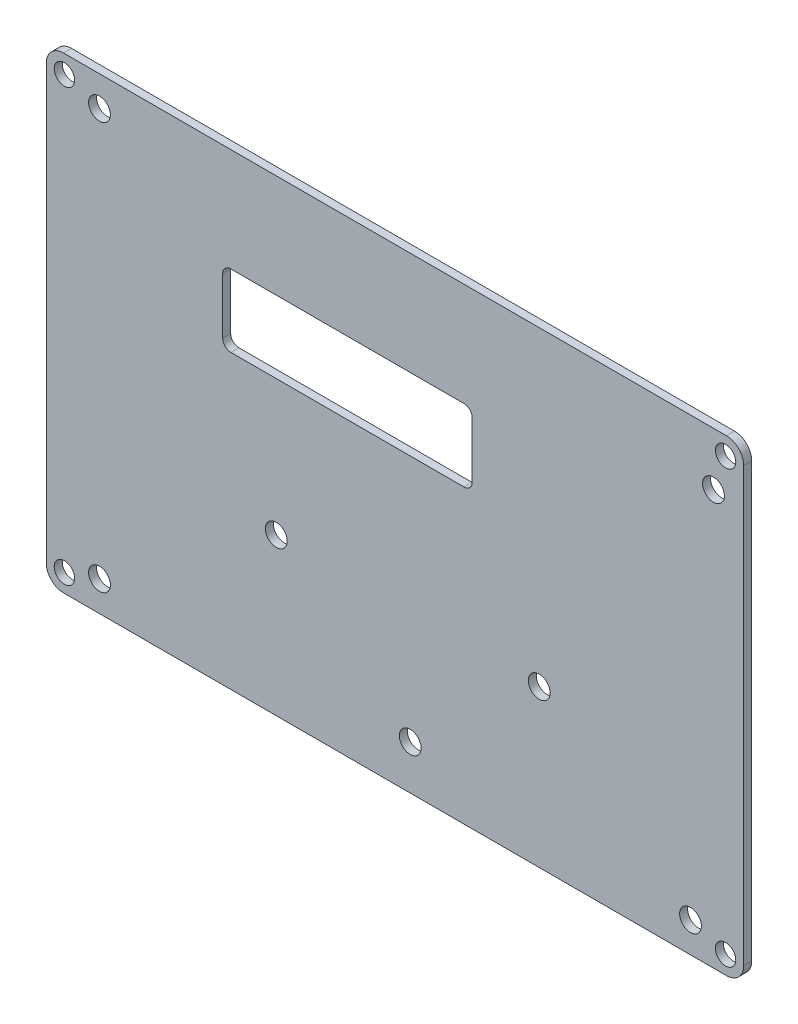
ISO-10303-21;
HEADER;
FILE_DESCRIPTION(('STEP AP214'),'2;1');
FILE_NAME('part.step','',(''),(''),'','','');
FILE_SCHEMA(('AUTOMOTIVE_DESIGN { 1 0 10303 214 1 1 1 1 }'));
ENDSEC;
DATA;
#1=APPLICATION_CONTEXT('core data for automotive mechanical design processes');
#2=APPLICATION_PROTOCOL_DEFINITION('international standard','automotive_design',2000,#1);
#3=PRODUCT_CONTEXT('',#1,'mechanical');
#4=PRODUCT('Part','Part','',(#3));
#5=PRODUCT_RELATED_PRODUCT_CATEGORY('part','',(#4));
#6=PRODUCT_DEFINITION_FORMATION('','',#4);
#7=PRODUCT_DEFINITION_CONTEXT('part definition',#1,'design');
#8=PRODUCT_DEFINITION('design','',#6,#7);
#9=PRODUCT_DEFINITION_SHAPE('','',#8);
#10=(LENGTH_UNIT() NAMED_UNIT(*) SI_UNIT(.MILLI.,.METRE.));
#11=(NAMED_UNIT(*) PLANE_ANGLE_UNIT() SI_UNIT($,.RADIAN.));
#12=(NAMED_UNIT(*) SI_UNIT($,.STERADIAN.) SOLID_ANGLE_UNIT());
#13=UNCERTAINTY_MEASURE_WITH_UNIT(LENGTH_MEASURE(1.E-05),#10,'distance_accuracy_value','');
#14=(GEOMETRIC_REPRESENTATION_CONTEXT(3) GLOBAL_UNCERTAINTY_ASSIGNED_CONTEXT((#13)) GLOBAL_UNIT_ASSIGNED_CONTEXT((#10,
#11,#12)) REPRESENTATION_CONTEXT('',''));
#15=CARTESIAN_POINT('',(0.,0.,0.));
#16=DIRECTION('',(0.,0.,1.));
#17=DIRECTION('',(1.,0.,0.));
#18=AXIS2_PLACEMENT_3D('',#15,#16,#17);
#19=CARTESIAN_POINT('',(-6.95960000000001,81.2546,0.));
#20=DIRECTION('',(0.,0.,-1.));
#21=DIRECTION('',(-1.,0.,0.));
#22=AXIS2_PLACEMENT_3D('',#19,#20,#21);
#23=PLANE('',#22);
#24=CARTESIAN_POINT('',(-6.95960000000001,-2.51459999999998,0.));
#25=DIRECTION('',(0.,0.,-1.));
#26=DIRECTION('',(-1.,0.,0.));
#27=AXIS2_PLACEMENT_3D('',#24,#25,#26);
#28=CIRCLE('',#27,3.3274);
#29=CARTESIAN_POINT('',(-10.287,-2.51459999999998,0.));
#30=VERTEX_POINT('',#29);
#31=CARTESIAN_POINT('',(-6.95960000000001,-5.84199999999998,0.));
#32=VERTEX_POINT('',#31);
#33=EDGE_CURVE('E232',#30,#32,#28,.F.);
#34=ORIENTED_EDGE('',*,*,#33,.F.);
#35=DIRECTION('',(0.,1.,0.));
#36=VECTOR('',#35,1.);
#37=CARTESIAN_POINT('',(-10.287,-2.51459999999998,0.));
#38=LINE('',#37,#36);
#39=CARTESIAN_POINT('',(-10.287,81.2546,0.));
#40=VERTEX_POINT('',#39);
#41=EDGE_CURVE('E231',#30,#40,#38,.T.);
#42=ORIENTED_EDGE('',*,*,#41,.T.);
#43=CARTESIAN_POINT('',(-6.95960000000001,81.2546,0.));
#44=DIRECTION('',(0.,0.,-1.));
#45=DIRECTION('',(-1.,0.,0.));
#46=AXIS2_PLACEMENT_3D('',#43,#44,#45);
#47=CIRCLE('',#46,3.3274);
#48=CARTESIAN_POINT('',(-6.95960000000001,84.582,0.));
#49=VERTEX_POINT('',#48);
#50=EDGE_CURVE('E229',#49,#40,#47,.F.);
#51=ORIENTED_EDGE('',*,*,#50,.F.);
#52=DIRECTION('',(1.,0.,0.));
#53=VECTOR('',#52,1.);
#54=CARTESIAN_POINT('',(-6.95960000000001,84.582,0.));
#55=LINE('',#54,#53);
#56=CARTESIAN_POINT('',(121.2596,84.582,0.));
#57=VERTEX_POINT('',#56);
#58=EDGE_CURVE('E242',#49,#57,#55,.T.);
#59=ORIENTED_EDGE('',*,*,#58,.T.);
#60=CARTESIAN_POINT('',(121.2596,81.2546,0.));
#61=DIRECTION('',(0.,0.,-1.));
#62=DIRECTION('',(-1.,0.,0.));
#63=AXIS2_PLACEMENT_3D('',#60,#61,#62);
#64=CIRCLE('',#63,3.32739999999999);
#65=CARTESIAN_POINT('',(124.587,81.2546,0.));
#66=VERTEX_POINT('',#65);
#67=EDGE_CURVE('E239',#66,#57,#64,.F.);
#68=ORIENTED_EDGE('',*,*,#67,.F.);
#69=DIRECTION('',(0.,-1.,0.));
#70=VECTOR('',#69,1.);
#71=CARTESIAN_POINT('',(124.587,-2.51459999999998,0.));
#72=LINE('',#71,#70);
#73=CARTESIAN_POINT('',(124.587,-2.51459999999998,0.));
#74=VERTEX_POINT('',#73);
#75=EDGE_CURVE('E156',#66,#74,#72,.T.);
#76=ORIENTED_EDGE('',*,*,#75,.T.);
#77=CARTESIAN_POINT('',(121.2596,-2.51459999999998,0.));
#78=DIRECTION('',(0.,0.,-1.));
#79=DIRECTION('',(-1.,0.,0.));
#80=AXIS2_PLACEMENT_3D('',#77,#78,#79);
#81=CIRCLE('',#80,3.32740000000001);
#82=CARTESIAN_POINT('',(121.2596,-5.84199999999999,0.));
#83=VERTEX_POINT('',#82);
#84=EDGE_CURVE('E236',#83,#74,#81,.F.);
#85=ORIENTED_EDGE('',*,*,#84,.F.);
#86=DIRECTION('',(1.,0.,0.));
#87=VECTOR('',#86,1.);
#88=CARTESIAN_POINT('',(-6.95960000000001,-5.84199999999999,0.));
#89=LINE('',#88,#87);
#90=EDGE_CURVE('E235',#83,#32,#89,.F.);
#91=ORIENTED_EDGE('',*,*,#90,.T.);
#92=EDGE_LOOP('',(#34,#42,#51,#59,#68,#76,#85,#91));
#93=FACE_BOUND('',#92,.T.);
#94=CARTESIAN_POINT('',(-6.78200000000001,81.077,0.));
#95=DIRECTION('',(0.,0.,1.));
#96=DIRECTION('',(1.,0.,0.));
#97=AXIS2_PLACEMENT_3D('',#94,#95,#96);
#98=CIRCLE('',#97,1.97);
#99=CARTESIAN_POINT('',(-4.81200000000001,81.077,0.));
#100=VERTEX_POINT('',#99);
#101=EDGE_CURVE('E243',#100,#100,#98,.T.);
#102=ORIENTED_EDGE('',*,*,#101,.T.);
#103=EDGE_LOOP('',(#102));
#104=FACE_BOUND('',#103,.T.);
#105=CARTESIAN_POINT('',(-6.78200000000001,-2.33699999999998,0.));
#106=DIRECTION('',(0.,0.,1.));
#107=DIRECTION('',(1.,0.,0.));
#108=AXIS2_PLACEMENT_3D('',#105,#106,#107);
#109=CIRCLE('',#108,1.97);
#110=CARTESIAN_POINT('',(-4.81200000000001,-2.33699999999998,0.));
#111=VERTEX_POINT('',#110);
#112=EDGE_CURVE('E246',#111,#111,#109,.T.);
#113=ORIENTED_EDGE('',*,*,#112,.T.);
#114=EDGE_LOOP('',(#113));
#115=FACE_BOUND('',#114,.T.);
#116=CARTESIAN_POINT('',(121.082,-2.33699999999998,0.));
#117=DIRECTION('',(0.,0.,1.));
#118=DIRECTION('',(1.,0.,0.));
#119=AXIS2_PLACEMENT_3D('',#116,#117,#118);
#120=CIRCLE('',#119,1.97);
#121=CARTESIAN_POINT('',(123.052,-2.33699999999998,0.));
#122=VERTEX_POINT('',#121);
#123=EDGE_CURVE('E249',#122,#122,#120,.T.);
#124=ORIENTED_EDGE('',*,*,#123,.T.);
#125=EDGE_LOOP('',(#124));
#126=FACE_BOUND('',#125,.T.);
#127=CARTESIAN_POINT('',(121.082,81.077,0.));
#128=DIRECTION('',(0.,0.,1.));
#129=DIRECTION('',(1.,0.,0.));
#130=AXIS2_PLACEMENT_3D('',#127,#128,#129);
#131=CIRCLE('',#130,1.97);
#132=CARTESIAN_POINT('',(123.052,81.077,0.));
#133=VERTEX_POINT('',#132);
#134=EDGE_CURVE('E146',#133,#133,#131,.T.);
#135=ORIENTED_EDGE('',*,*,#134,.T.);
#136=EDGE_LOOP('',(#135));
#137=FACE_BOUND('',#136,.T.);
#138=CARTESIAN_POINT('',(70.4977,63.0047,0.));
#139=DIRECTION('',(0.,0.,-1.));
#140=DIRECTION('',(-1.,0.,0.));
#141=AXIS2_PLACEMENT_3D('',#138,#139,#140);
#142=CIRCLE('',#141,1.58750000000001);
#143=CARTESIAN_POINT('',(72.0852,63.0047,0.));
#144=VERTEX_POINT('',#143);
#145=CARTESIAN_POINT('',(70.4977,64.5922,0.));
#146=VERTEX_POINT('',#145);
#147=EDGE_CURVE('E255',#144,#146,#142,.F.);
#148=ORIENTED_EDGE('',*,*,#147,.T.);
#149=DIRECTION('',(-1.,0.,0.));
#150=VECTOR('',#149,1.);
#151=CARTESIAN_POINT('',(25.4127,64.5922,0.));
#152=LINE('',#151,#150);
#153=CARTESIAN_POINT('',(25.4127,64.5922,0.));
#154=VERTEX_POINT('',#153);
#155=EDGE_CURVE('E158',#146,#154,#152,.T.);
#156=ORIENTED_EDGE('',*,*,#155,.T.);
#157=CARTESIAN_POINT('',(25.4127,63.0047,0.));
#158=DIRECTION('',(0.,0.,-1.));
#159=DIRECTION('',(-1.,0.,0.));
#160=AXIS2_PLACEMENT_3D('',#157,#158,#159);
#161=CIRCLE('',#160,1.58750000000001);
#162=CARTESIAN_POINT('',(23.8252,63.0047,0.));
#163=VERTEX_POINT('',#162);
#164=EDGE_CURVE('E150',#154,#163,#161,.F.);
#165=ORIENTED_EDGE('',*,*,#164,.T.);
#166=DIRECTION('',(0.,1.,0.));
#167=VECTOR('',#166,1.);
#168=CARTESIAN_POINT('',(23.8252,52.2097,0.));
#169=LINE('',#168,#167);
#170=CARTESIAN_POINT('',(23.8252,52.2097,0.));
#171=VERTEX_POINT('',#170);
#172=EDGE_CURVE('E142',#163,#171,#169,.F.);
#173=ORIENTED_EDGE('',*,*,#172,.T.);
#174=CARTESIAN_POINT('',(25.4127,52.2097,0.));
#175=DIRECTION('',(0.,0.,-1.));
#176=DIRECTION('',(-1.,0.,0.));
#177=AXIS2_PLACEMENT_3D('',#174,#175,#176);
#178=CIRCLE('',#177,1.58750000000001);
#179=CARTESIAN_POINT('',(25.4127,50.6222,0.));
#180=VERTEX_POINT('',#179);
#181=EDGE_CURVE('E127',#171,#180,#178,.F.);
#182=ORIENTED_EDGE('',*,*,#181,.T.);
#183=DIRECTION('',(1.,0.,0.));
#184=VECTOR('',#183,1.);
#185=CARTESIAN_POINT('',(70.4977,50.6222,0.));
#186=LINE('',#185,#184);
#187=CARTESIAN_POINT('',(70.4977,50.6222,0.));
#188=VERTEX_POINT('',#187);
#189=EDGE_CURVE('E166',#180,#188,#186,.T.);
#190=ORIENTED_EDGE('',*,*,#189,.T.);
#191=CARTESIAN_POINT('',(70.4977,52.2097,0.));
#192=DIRECTION('',(0.,0.,-1.));
#193=DIRECTION('',(-1.,0.,0.));
#194=AXIS2_PLACEMENT_3D('',#191,#192,#193);
#195=CIRCLE('',#194,1.58749999999999);
#196=CARTESIAN_POINT('',(72.0852,52.2097,0.));
#197=VERTEX_POINT('',#196);
#198=EDGE_CURVE('E257',#188,#197,#195,.F.);
#199=ORIENTED_EDGE('',*,*,#198,.T.);
#200=DIRECTION('',(0.,1.,0.));
#201=VECTOR('',#200,1.);
#202=CARTESIAN_POINT('',(72.0852,63.0047,0.));
#203=LINE('',#202,#201);
#204=EDGE_CURVE('E162',#197,#144,#203,.T.);
#205=ORIENTED_EDGE('',*,*,#204,.T.);
#206=EDGE_LOOP('',(#148,#156,#165,#173,#182,#190,#199,#205));
#207=FACE_BOUND('',#206,.T.);
#208=CARTESIAN_POINT('',(85.0392,24.4426587600001,0.));
#209=DIRECTION('',(0.,0.,1.));
#210=DIRECTION('',(1.,0.,0.));
#211=AXIS2_PLACEMENT_3D('',#208,#209,#210);
#212=CIRCLE('',#211,2.10819999999999);
#213=CARTESIAN_POINT('',(87.1474,24.4426587600001,0.));
#214=VERTEX_POINT('',#213);
#215=EDGE_CURVE('E137',#214,#214,#212,.T.);
#216=ORIENTED_EDGE('',*,*,#215,.T.);
#217=EDGE_LOOP('',(#216));
#218=FACE_BOUND('',#217,.T.);
#219=CARTESIAN_POINT('',(34.1884,24.4426587600001,0.));
#220=DIRECTION('',(0.,0.,1.));
#221=DIRECTION('',(1.,0.,0.));
#222=AXIS2_PLACEMENT_3D('',#219,#220,#221);
#223=CIRCLE('',#222,2.1082);
#224=CARTESIAN_POINT('',(36.2966,24.4426587600001,0.));
#225=VERTEX_POINT('',#224);
#226=EDGE_CURVE('E261',#225,#225,#223,.T.);
#227=ORIENTED_EDGE('',*,*,#226,.T.);
#228=EDGE_LOOP('',(#227));
#229=FACE_BOUND('',#228,.T.);
#230=CARTESIAN_POINT('',(0.,0.,0.));
#231=DIRECTION('',(0.,0.,1.));
#232=DIRECTION('',(1.,0.,0.));
#233=AXIS2_PLACEMENT_3D('',#230,#231,#232);
#234=CIRCLE('',#233,2.1082);
#235=CARTESIAN_POINT('',(2.1082,0.,0.));
#236=VERTEX_POINT('',#235);
#237=EDGE_CURVE('E264',#236,#236,#234,.T.);
#238=ORIENTED_EDGE('',*,*,#237,.T.);
#239=EDGE_LOOP('',(#238));
#240=FACE_BOUND('',#239,.T.);
#241=CARTESIAN_POINT('',(0.,78.74,0.));
#242=DIRECTION('',(0.,0.,1.));
#243=DIRECTION('',(1.,0.,0.));
#244=AXIS2_PLACEMENT_3D('',#241,#242,#243);
#245=CIRCLE('',#244,2.1082);
#246=CARTESIAN_POINT('',(2.1082,78.74,0.));
#247=VERTEX_POINT('',#246);
#248=EDGE_CURVE('E267',#247,#247,#245,.T.);
#249=ORIENTED_EDGE('',*,*,#248,.T.);
#250=EDGE_LOOP('',(#249));
#251=FACE_BOUND('',#250,.T.);
#252=CARTESIAN_POINT('',(118.745,74.295,0.));
#253=DIRECTION('',(0.,0.,1.));
#254=DIRECTION('',(1.,0.,0.));
#255=AXIS2_PLACEMENT_3D('',#252,#253,#254);
#256=CIRCLE('',#255,2.1082);
#257=CARTESIAN_POINT('',(120.8532,74.295,0.));
#258=VERTEX_POINT('',#257);
#259=EDGE_CURVE('E270',#258,#258,#256,.T.);
#260=ORIENTED_EDGE('',*,*,#259,.T.);
#261=EDGE_LOOP('',(#260));
#262=FACE_BOUND('',#261,.T.);
#263=CARTESIAN_POINT('',(60.0964,2.72565875999997,0.));
#264=DIRECTION('',(0.,0.,1.));
#265=DIRECTION('',(1.,0.,0.));
#266=AXIS2_PLACEMENT_3D('',#263,#264,#265);
#267=CIRCLE('',#266,2.1082);
#268=CARTESIAN_POINT('',(62.2046,2.72565875999997,0.));
#269=VERTEX_POINT('',#268);
#270=EDGE_CURVE('E272',#269,#269,#267,.T.);
#271=ORIENTED_EDGE('',*,*,#270,.T.);
#272=EDGE_LOOP('',(#271));
#273=FACE_BOUND('',#272,.T.);
#274=CARTESIAN_POINT('',(114.3,0.,0.));
#275=DIRECTION('',(0.,0.,1.));
#276=DIRECTION('',(1.,0.,0.));
#277=AXIS2_PLACEMENT_3D('',#274,#275,#276);
#278=CIRCLE('',#277,2.10819999999999);
#279=CARTESIAN_POINT('',(116.4082,0.,0.));
#280=VERTEX_POINT('',#279);
#281=EDGE_CURVE('E20',#280,#280,#278,.T.);
#282=ORIENTED_EDGE('',*,*,#281,.T.);
#283=EDGE_LOOP('',(#282));
#284=FACE_BOUND('',#283,.T.);
#285=ADVANCED_FACE('F17',(#93,#104,#115,#126,#137,#207,#218,#229,#240,#251,#262,#273,#284),#23,.T.);
#286=CARTESIAN_POINT('',(114.3,0.,-0.001000000000001));
#287=DIRECTION('',(0.,0.,1.));
#288=DIRECTION('',(1.,0.,0.));
#289=AXIS2_PLACEMENT_3D('',#286,#287,#288);
#290=CYLINDRICAL_SURFACE('',#289,2.10819999999999);
#291=ORIENTED_EDGE('',*,*,#281,.F.);
#292=EDGE_LOOP('',(#291));
#293=FACE_BOUND('',#292,.T.);
#294=CARTESIAN_POINT('',(114.3,0.,1.5494));
#295=DIRECTION('',(0.,0.,1.));
#296=DIRECTION('',(1.,0.,0.));
#297=AXIS2_PLACEMENT_3D('',#294,#295,#296);
#298=CIRCLE('',#297,2.10819999999999);
#299=CARTESIAN_POINT('',(116.4082,0.,1.5494));
#300=VERTEX_POINT('',#299);
#301=EDGE_CURVE('E225',#300,#300,#298,.T.);
#302=ORIENTED_EDGE('',*,*,#301,.T.);
#303=EDGE_LOOP('',(#302));
#304=FACE_BOUND('',#303,.T.);
#305=ADVANCED_FACE('F280',(#293,#304),#290,.F.);
#306=CARTESIAN_POINT('',(60.0964,2.72565875999997,-0.001000000000001));
#307=DIRECTION('',(0.,0.,1.));
#308=DIRECTION('',(1.,0.,0.));
#309=AXIS2_PLACEMENT_3D('',#306,#307,#308);
#310=CYLINDRICAL_SURFACE('',#309,2.1082);
#311=ORIENTED_EDGE('',*,*,#270,.F.);
#312=EDGE_LOOP('',(#311));
#313=FACE_BOUND('',#312,.T.);
#314=CARTESIAN_POINT('',(60.0964,2.72565875999997,1.5494));
#315=DIRECTION('',(0.,0.,1.));
#316=DIRECTION('',(1.,0.,0.));
#317=AXIS2_PLACEMENT_3D('',#314,#315,#316);
#318=CIRCLE('',#317,2.1082);
#319=CARTESIAN_POINT('',(62.2046,2.72565875999997,1.5494));
#320=VERTEX_POINT('',#319);
#321=EDGE_CURVE('E222',#320,#320,#318,.T.);
#322=ORIENTED_EDGE('',*,*,#321,.T.);
#323=EDGE_LOOP('',(#322));
#324=FACE_BOUND('',#323,.T.);
#325=ADVANCED_FACE('F283',(#313,#324),#310,.F.);
#326=CARTESIAN_POINT('',(118.745,74.295,-0.001000000000001));
#327=DIRECTION('',(0.,0.,1.));
#328=DIRECTION('',(1.,0.,0.));
#329=AXIS2_PLACEMENT_3D('',#326,#327,#328);
#330=CYLINDRICAL_SURFACE('',#329,2.1082);
#331=ORIENTED_EDGE('',*,*,#259,.F.);
#332=EDGE_LOOP('',(#331));
#333=FACE_BOUND('',#332,.T.);
#334=CARTESIAN_POINT('',(118.745,74.295,1.5494));
#335=DIRECTION('',(0.,0.,1.));
#336=DIRECTION('',(1.,0.,0.));
#337=AXIS2_PLACEMENT_3D('',#334,#335,#336);
#338=CIRCLE('',#337,2.1082);
#339=CARTESIAN_POINT('',(120.8532,74.295,1.5494));
#340=VERTEX_POINT('',#339);
#341=EDGE_CURVE('E219',#340,#340,#338,.T.);
#342=ORIENTED_EDGE('',*,*,#341,.T.);
#343=EDGE_LOOP('',(#342));
#344=FACE_BOUND('',#343,.T.);
#345=ADVANCED_FACE('F386',(#333,#344),#330,.F.);
#346=CARTESIAN_POINT('',(0.,78.74,-0.001000000000001));
#347=DIRECTION('',(0.,0.,1.));
#348=DIRECTION('',(1.,0.,0.));
#349=AXIS2_PLACEMENT_3D('',#346,#347,#348);
#350=CYLINDRICAL_SURFACE('',#349,2.1082);
#351=ORIENTED_EDGE('',*,*,#248,.F.);
#352=EDGE_LOOP('',(#351));
#353=FACE_BOUND('',#352,.T.);
#354=CARTESIAN_POINT('',(0.,78.74,1.5494));
#355=DIRECTION('',(0.,0.,1.));
#356=DIRECTION('',(1.,0.,0.));
#357=AXIS2_PLACEMENT_3D('',#354,#355,#356);
#358=CIRCLE('',#357,2.1082);
#359=CARTESIAN_POINT('',(2.1082,78.74,1.5494));
#360=VERTEX_POINT('',#359);
#361=EDGE_CURVE('E216',#360,#360,#358,.T.);
#362=ORIENTED_EDGE('',*,*,#361,.T.);
#363=EDGE_LOOP('',(#362));
#364=FACE_BOUND('',#363,.T.);
#365=ADVANCED_FACE('F382',(#353,#364),#350,.F.);
#366=CARTESIAN_POINT('',(0.,0.,-0.001000000000001));
#367=DIRECTION('',(0.,0.,1.));
#368=DIRECTION('',(1.,0.,0.));
#369=AXIS2_PLACEMENT_3D('',#366,#367,#368);
#370=CYLINDRICAL_SURFACE('',#369,2.1082);
#371=ORIENTED_EDGE('',*,*,#237,.F.);
#372=EDGE_LOOP('',(#371));
#373=FACE_BOUND('',#372,.T.);
#374=CARTESIAN_POINT('',(0.,0.,1.5494));
#375=DIRECTION('',(0.,0.,1.));
#376=DIRECTION('',(1.,0.,0.));
#377=AXIS2_PLACEMENT_3D('',#374,#375,#376);
#378=CIRCLE('',#377,2.1082);
#379=CARTESIAN_POINT('',(2.1082,0.,1.5494));
#380=VERTEX_POINT('',#379);
#381=EDGE_CURVE('E213',#380,#380,#378,.T.);
#382=ORIENTED_EDGE('',*,*,#381,.T.);
#383=EDGE_LOOP('',(#382));
#384=FACE_BOUND('',#383,.T.);
#385=ADVANCED_FACE('F378',(#373,#384),#370,.F.);
#386=CARTESIAN_POINT('',(34.1884,24.4426587600001,-0.001000000000001));
#387=DIRECTION('',(0.,0.,1.));
#388=DIRECTION('',(1.,0.,0.));
#389=AXIS2_PLACEMENT_3D('',#386,#387,#388);
#390=CYLINDRICAL_SURFACE('',#389,2.1082);
#391=ORIENTED_EDGE('',*,*,#226,.F.);
#392=EDGE_LOOP('',(#391));
#393=FACE_BOUND('',#392,.T.);
#394=CARTESIAN_POINT('',(34.1884,24.4426587600001,1.5494));
#395=DIRECTION('',(0.,0.,1.));
#396=DIRECTION('',(1.,0.,0.));
#397=AXIS2_PLACEMENT_3D('',#394,#395,#396);
#398=CIRCLE('',#397,2.1082);
#399=CARTESIAN_POINT('',(36.2966,24.4426587600001,1.5494));
#400=VERTEX_POINT('',#399);
#401=EDGE_CURVE('E210',#400,#400,#398,.T.);
#402=ORIENTED_EDGE('',*,*,#401,.T.);
#403=EDGE_LOOP('',(#402));
#404=FACE_BOUND('',#403,.T.);
#405=ADVANCED_FACE('F374',(#393,#404),#390,.F.);
#406=CARTESIAN_POINT('',(85.0392,24.4426587600001,-0.001000000000001));
#407=DIRECTION('',(0.,0.,1.));
#408=DIRECTION('',(1.,0.,0.));
#409=AXIS2_PLACEMENT_3D('',#406,#407,#408);
#410=CYLINDRICAL_SURFACE('',#409,2.10819999999999);
#411=ORIENTED_EDGE('',*,*,#215,.F.);
#412=EDGE_LOOP('',(#411));
#413=FACE_BOUND('',#412,.T.);
#414=CARTESIAN_POINT('',(85.0392,24.4426587600001,1.5494));
#415=DIRECTION('',(0.,0.,1.));
#416=DIRECTION('',(1.,0.,0.));
#417=AXIS2_PLACEMENT_3D('',#414,#415,#416);
#418=CIRCLE('',#417,2.10819999999999);
#419=CARTESIAN_POINT('',(87.1474,24.4426587600001,1.5494));
#420=VERTEX_POINT('',#419);
#421=EDGE_CURVE('E207',#420,#420,#418,.T.);
#422=ORIENTED_EDGE('',*,*,#421,.T.);
#423=EDGE_LOOP('',(#422));
#424=FACE_BOUND('',#423,.T.);
#425=ADVANCED_FACE('F371',(#413,#424),#410,.F.);
#426=CARTESIAN_POINT('',(25.4127,52.2097,1.5504));
#427=DIRECTION('',(0.,0.,-1.));
#428=DIRECTION('',(-1.,0.,0.));
#429=AXIS2_PLACEMENT_3D('',#426,#427,#428);
#430=CYLINDRICAL_SURFACE('',#429,1.58750000000001);
#431=DIRECTION('',(0.,0.,1.));
#432=VECTOR('',#431,1.);
#433=CARTESIAN_POINT('',(25.4127,50.6222,1.5504));
#434=LINE('',#433,#432);
#435=CARTESIAN_POINT('',(25.4127,50.6222,1.5494));
#436=VERTEX_POINT('',#435);
#437=EDGE_CURVE('E133',#436,#180,#434,.F.);
#438=ORIENTED_EDGE('',*,*,#437,.T.);
#439=ORIENTED_EDGE('',*,*,#181,.F.);
#440=DIRECTION('',(0.,0.,1.));
#441=VECTOR('',#440,1.);
#442=CARTESIAN_POINT('',(23.8252,52.2097,1.5504));
#443=LINE('',#442,#441);
#444=CARTESIAN_POINT('',(23.8252,52.2097,1.5494));
#445=VERTEX_POINT('',#444);
#446=EDGE_CURVE('E131',#171,#445,#443,.T.);
#447=ORIENTED_EDGE('',*,*,#446,.T.);
#448=CARTESIAN_POINT('',(25.4127,52.2097,1.5494));
#449=DIRECTION('',(0.,0.,-1.));
#450=DIRECTION('',(-1.,0.,0.));
#451=AXIS2_PLACEMENT_3D('',#448,#449,#450);
#452=CIRCLE('',#451,1.58750000000001);
#453=EDGE_CURVE('E205',#445,#436,#452,.F.);
#454=ORIENTED_EDGE('',*,*,#453,.T.);
#455=EDGE_LOOP('',(#438,#439,#447,#454));
#456=FACE_BOUND('',#455,.T.);
#457=ADVANCED_FACE('F129',(#456),#430,.F.);
#458=CARTESIAN_POINT('',(70.4977,50.6222,1.5504));
#459=DIRECTION('',(0.,-1.,0.));
#460=DIRECTION('',(1.,0.,0.));
#461=AXIS2_PLACEMENT_3D('',#458,#459,#460);
#462=PLANE('',#461);
#463=DIRECTION('',(0.,0.,-1.));
#464=VECTOR('',#463,1.);
#465=CARTESIAN_POINT('',(70.4977,50.6222,1.5504));
#466=LINE('',#465,#464);
#467=CARTESIAN_POINT('',(70.4977,50.6222,1.5494));
#468=VERTEX_POINT('',#467);
#469=EDGE_CURVE('E167',#468,#188,#466,.T.);
#470=ORIENTED_EDGE('',*,*,#469,.T.);
#471=ORIENTED_EDGE('',*,*,#189,.F.);
#472=ORIENTED_EDGE('',*,*,#437,.F.);
#473=DIRECTION('',(-1.,0.,0.));
#474=VECTOR('',#473,1.);
#475=CARTESIAN_POINT('',(-6.95960000000001,50.6222,1.5494));
#476=LINE('',#475,#474);
#477=EDGE_CURVE('E204',#436,#468,#476,.F.);
#478=ORIENTED_EDGE('',*,*,#477,.T.);
#479=EDGE_LOOP('',(#470,#471,#472,#478));
#480=FACE_BOUND('',#479,.T.);
#481=ADVANCED_FACE('F364',(#480),#462,.F.);
#482=CARTESIAN_POINT('',(70.4977,52.2097,1.5504));
#483=DIRECTION('',(0.,0.,-1.));
#484=DIRECTION('',(-1.,0.,0.));
#485=AXIS2_PLACEMENT_3D('',#482,#483,#484);
#486=CYLINDRICAL_SURFACE('',#485,1.58749999999999);
#487=DIRECTION('',(0.,0.,1.));
#488=VECTOR('',#487,1.);
#489=CARTESIAN_POINT('',(72.0852,52.2097,1.5504));
#490=LINE('',#489,#488);
#491=CARTESIAN_POINT('',(72.0852,52.2097,1.5494));
#492=VERTEX_POINT('',#491);
#493=EDGE_CURVE('E165',#492,#197,#490,.F.);
#494=ORIENTED_EDGE('',*,*,#493,.T.);
#495=ORIENTED_EDGE('',*,*,#198,.F.);
#496=ORIENTED_EDGE('',*,*,#469,.F.);
#497=CARTESIAN_POINT('',(70.4977,52.2097,1.5494));
#498=DIRECTION('',(0.,0.,-1.));
#499=DIRECTION('',(-1.,0.,0.));
#500=AXIS2_PLACEMENT_3D('',#497,#498,#499);
#501=CIRCLE('',#500,1.58749999999999);
#502=EDGE_CURVE('E201',#468,#492,#501,.F.);
#503=ORIENTED_EDGE('',*,*,#502,.T.);
#504=EDGE_LOOP('',(#494,#495,#496,#503));
#505=FACE_BOUND('',#504,.T.);
#506=ADVANCED_FACE('F360',(#505),#486,.F.);
#507=CARTESIAN_POINT('',(72.0852,63.0047,1.5504));
#508=DIRECTION('',(1.,0.,0.));
#509=DIRECTION('',(0.,1.,0.));
#510=AXIS2_PLACEMENT_3D('',#507,#508,#509);
#511=PLANE('',#510);
#512=DIRECTION('',(0.,0.,-1.));
#513=VECTOR('',#512,1.);
#514=CARTESIAN_POINT('',(72.0852,63.0047,1.5504));
#515=LINE('',#514,#513);
#516=CARTESIAN_POINT('',(72.0852,63.0047,1.5494));
#517=VERTEX_POINT('',#516);
#518=EDGE_CURVE('E164',#517,#144,#515,.T.);
#519=ORIENTED_EDGE('',*,*,#518,.T.);
#520=ORIENTED_EDGE('',*,*,#204,.F.);
#521=ORIENTED_EDGE('',*,*,#493,.F.);
#522=DIRECTION('',(0.,1.,0.));
#523=VECTOR('',#522,1.);
#524=CARTESIAN_POINT('',(72.0852,81.2546,1.5494));
#525=LINE('',#524,#523);
#526=EDGE_CURVE('E200',#492,#517,#525,.T.);
#527=ORIENTED_EDGE('',*,*,#526,.T.);
#528=EDGE_LOOP('',(#519,#520,#521,#527));
#529=FACE_BOUND('',#528,.T.);
#530=ADVANCED_FACE('F356',(#529),#511,.F.);
#531=CARTESIAN_POINT('',(70.4977,63.0047,1.5504));
#532=DIRECTION('',(0.,0.,-1.));
#533=DIRECTION('',(-1.,0.,0.));
#534=AXIS2_PLACEMENT_3D('',#531,#532,#533);
#535=CYLINDRICAL_SURFACE('',#534,1.58750000000001);
#536=DIRECTION('',(0.,0.,1.));
#537=VECTOR('',#536,1.);
#538=CARTESIAN_POINT('',(70.4977,64.5922,1.5504));
#539=LINE('',#538,#537);
#540=CARTESIAN_POINT('',(70.4977,64.5922,1.5494));
#541=VERTEX_POINT('',#540);
#542=EDGE_CURVE('E161',#541,#146,#539,.F.);
#543=ORIENTED_EDGE('',*,*,#542,.T.);
#544=ORIENTED_EDGE('',*,*,#147,.F.);
#545=ORIENTED_EDGE('',*,*,#518,.F.);
#546=CARTESIAN_POINT('',(70.4977,63.0047,1.5494));
#547=DIRECTION('',(0.,0.,-1.));
#548=DIRECTION('',(-1.,0.,0.));
#549=AXIS2_PLACEMENT_3D('',#546,#547,#548);
#550=CIRCLE('',#549,1.58750000000001);
#551=EDGE_CURVE('E197',#517,#541,#550,.F.);
#552=ORIENTED_EDGE('',*,*,#551,.T.);
#553=EDGE_LOOP('',(#543,#544,#545,#552));
#554=FACE_BOUND('',#553,.T.);
#555=ADVANCED_FACE('F352',(#554),#535,.F.);
#556=CARTESIAN_POINT('',(25.4127,64.5922,1.5504));
#557=DIRECTION('',(0.,1.,0.));
#558=DIRECTION('',(-1.,0.,0.));
#559=AXIS2_PLACEMENT_3D('',#556,#557,#558);
#560=PLANE('',#559);
#561=DIRECTION('',(0.,0.,-1.));
#562=VECTOR('',#561,1.);
#563=CARTESIAN_POINT('',(25.4127,64.5922,1.5504));
#564=LINE('',#563,#562);
#565=CARTESIAN_POINT('',(25.4127,64.5922,1.5494));
#566=VERTEX_POINT('',#565);
#567=EDGE_CURVE('E160',#566,#154,#564,.T.);
#568=ORIENTED_EDGE('',*,*,#567,.T.);
#569=ORIENTED_EDGE('',*,*,#155,.F.);
#570=ORIENTED_EDGE('',*,*,#542,.F.);
#571=DIRECTION('',(-1.,0.,0.));
#572=VECTOR('',#571,1.);
#573=CARTESIAN_POINT('',(-6.95960000000001,64.5922,1.5494));
#574=LINE('',#573,#572);
#575=EDGE_CURVE('E196',#541,#566,#574,.T.);
#576=ORIENTED_EDGE('',*,*,#575,.T.);
#577=EDGE_LOOP('',(#568,#569,#570,#576));
#578=FACE_BOUND('',#577,.T.);
#579=ADVANCED_FACE('F348',(#578),#560,.F.);
#580=CARTESIAN_POINT('',(25.4127,63.0047,1.5504));
#581=DIRECTION('',(0.,0.,-1.));
#582=DIRECTION('',(-1.,0.,0.));
#583=AXIS2_PLACEMENT_3D('',#580,#581,#582);
#584=CYLINDRICAL_SURFACE('',#583,1.58750000000001);
#585=DIRECTION('',(0.,0.,1.));
#586=VECTOR('',#585,1.);
#587=CARTESIAN_POINT('',(23.8252,63.0047,1.5504));
#588=LINE('',#587,#586);
#589=CARTESIAN_POINT('',(23.8252,63.0047,1.5494));
#590=VERTEX_POINT('',#589);
#591=EDGE_CURVE('E151',#590,#163,#588,.F.);
#592=ORIENTED_EDGE('',*,*,#591,.T.);
#593=ORIENTED_EDGE('',*,*,#164,.F.);
#594=ORIENTED_EDGE('',*,*,#567,.F.);
#595=CARTESIAN_POINT('',(25.4127,63.0047,1.5494));
#596=DIRECTION('',(0.,0.,-1.));
#597=DIRECTION('',(-1.,0.,0.));
#598=AXIS2_PLACEMENT_3D('',#595,#596,#597);
#599=CIRCLE('',#598,1.58750000000001);
#600=EDGE_CURVE('E193',#566,#590,#599,.F.);
#601=ORIENTED_EDGE('',*,*,#600,.T.);
#602=EDGE_LOOP('',(#592,#593,#594,#601));
#603=FACE_BOUND('',#602,.T.);
#604=ADVANCED_FACE('F345',(#603),#584,.F.);
#605=CARTESIAN_POINT('',(23.8252,52.2097,1.5504));
#606=DIRECTION('',(-1.,0.,0.));
#607=DIRECTION('',(0.,0.,1.));
#608=AXIS2_PLACEMENT_3D('',#605,#606,#607);
#609=PLANE('',#608);
#610=ORIENTED_EDGE('',*,*,#446,.F.);
#611=ORIENTED_EDGE('',*,*,#172,.F.);
#612=ORIENTED_EDGE('',*,*,#591,.F.);
#613=DIRECTION('',(0.,1.,0.));
#614=VECTOR('',#613,1.);
#615=CARTESIAN_POINT('',(23.8252,81.2546,1.5494));
#616=LINE('',#615,#614);
#617=EDGE_CURVE('E145',#590,#445,#616,.F.);
#618=ORIENTED_EDGE('',*,*,#617,.T.);
#619=EDGE_LOOP('',(#610,#611,#612,#618));
#620=FACE_BOUND('',#619,.T.);
#621=ADVANCED_FACE('F141',(#620),#609,.F.);
#622=CARTESIAN_POINT('',(121.082,81.077,0.));
#623=DIRECTION('',(0.,0.,1.));
#624=DIRECTION('',(1.,0.,0.));
#625=AXIS2_PLACEMENT_3D('',#622,#623,#624);
#626=CYLINDRICAL_SURFACE('',#625,1.97);
#627=ORIENTED_EDGE('',*,*,#134,.F.);
#628=EDGE_LOOP('',(#627));
#629=FACE_BOUND('',#628,.T.);
#630=CARTESIAN_POINT('',(121.082,81.077,1.5494));
#631=DIRECTION('',(0.,0.,1.));
#632=DIRECTION('',(1.,0.,0.));
#633=AXIS2_PLACEMENT_3D('',#630,#631,#632);
#634=CIRCLE('',#633,1.97);
#635=CARTESIAN_POINT('',(123.052,81.077,1.5494));
#636=VERTEX_POINT('',#635);
#637=EDGE_CURVE('E190',#636,#636,#634,.T.);
#638=ORIENTED_EDGE('',*,*,#637,.T.);
#639=EDGE_LOOP('',(#638));
#640=FACE_BOUND('',#639,.T.);
#641=ADVANCED_FACE('F338',(#629,#640),#626,.F.);
#642=CARTESIAN_POINT('',(121.082,-2.33699999999998,0.));
#643=DIRECTION('',(0.,0.,1.));
#644=DIRECTION('',(1.,0.,0.));
#645=AXIS2_PLACEMENT_3D('',#642,#643,#644);
#646=CYLINDRICAL_SURFACE('',#645,1.97);
#647=ORIENTED_EDGE('',*,*,#123,.F.);
#648=EDGE_LOOP('',(#647));
#649=FACE_BOUND('',#648,.T.);
#650=CARTESIAN_POINT('',(121.082,-2.33699999999998,1.5494));
#651=DIRECTION('',(0.,0.,1.));
#652=DIRECTION('',(1.,0.,0.));
#653=AXIS2_PLACEMENT_3D('',#650,#651,#652);
#654=CIRCLE('',#653,1.97);
#655=CARTESIAN_POINT('',(123.052,-2.33699999999998,1.5494));
#656=VERTEX_POINT('',#655);
#657=EDGE_CURVE('E187',#656,#656,#654,.T.);
#658=ORIENTED_EDGE('',*,*,#657,.T.);
#659=EDGE_LOOP('',(#658));
#660=FACE_BOUND('',#659,.T.);
#661=ADVANCED_FACE('F334',(#649,#660),#646,.F.);
#662=CARTESIAN_POINT('',(-6.78200000000001,-2.33699999999998,0.));
#663=DIRECTION('',(0.,0.,1.));
#664=DIRECTION('',(1.,0.,0.));
#665=AXIS2_PLACEMENT_3D('',#662,#663,#664);
#666=CYLINDRICAL_SURFACE('',#665,1.97);
#667=ORIENTED_EDGE('',*,*,#112,.F.);
#668=EDGE_LOOP('',(#667));
#669=FACE_BOUND('',#668,.T.);
#670=CARTESIAN_POINT('',(-6.78200000000001,-2.33699999999998,1.5494));
#671=DIRECTION('',(0.,0.,1.));
#672=DIRECTION('',(1.,0.,0.));
#673=AXIS2_PLACEMENT_3D('',#670,#671,#672);
#674=CIRCLE('',#673,1.97);
#675=CARTESIAN_POINT('',(-4.81200000000001,-2.33699999999998,1.5494));
#676=VERTEX_POINT('',#675);
#677=EDGE_CURVE('E184',#676,#676,#674,.T.);
#678=ORIENTED_EDGE('',*,*,#677,.T.);
#679=EDGE_LOOP('',(#678));
#680=FACE_BOUND('',#679,.T.);
#681=ADVANCED_FACE('F330',(#669,#680),#666,.F.);
#682=CARTESIAN_POINT('',(-6.78200000000001,81.077,0.));
#683=DIRECTION('',(0.,0.,1.));
#684=DIRECTION('',(1.,0.,0.));
#685=AXIS2_PLACEMENT_3D('',#682,#683,#684);
#686=CYLINDRICAL_SURFACE('',#685,1.97);
#687=ORIENTED_EDGE('',*,*,#101,.F.);
#688=EDGE_LOOP('',(#687));
#689=FACE_BOUND('',#688,.T.);
#690=CARTESIAN_POINT('',(-6.78200000000001,81.077,1.5494));
#691=DIRECTION('',(0.,0.,1.));
#692=DIRECTION('',(1.,0.,0.));
#693=AXIS2_PLACEMENT_3D('',#690,#691,#692);
#694=CIRCLE('',#693,1.97);
#695=CARTESIAN_POINT('',(-4.81200000000001,81.077,1.5494));
#696=VERTEX_POINT('',#695);
#697=EDGE_CURVE('E181',#696,#696,#694,.T.);
#698=ORIENTED_EDGE('',*,*,#697,.T.);
#699=EDGE_LOOP('',(#698));
#700=FACE_BOUND('',#699,.T.);
#701=ADVANCED_FACE('F326',(#689,#700),#686,.F.);
#702=CARTESIAN_POINT('',(-6.95960000000001,84.582,1.5494));
#703=DIRECTION('',(0.,-1.,0.));
#704=DIRECTION('',(0.,0.,-1.));
#705=AXIS2_PLACEMENT_3D('',#702,#703,#704);
#706=PLANE('',#705);
#707=DIRECTION('',(0.,0.,-1.));
#708=VECTOR('',#707,1.);
#709=CARTESIAN_POINT('',(-6.95960000000001,84.582,1.5494));
#710=LINE('',#709,#708);
#711=CARTESIAN_POINT('',(-6.95960000000001,84.582,1.5494));
#712=VERTEX_POINT('',#711);
#713=EDGE_CURVE('E228',#712,#49,#710,.T.);
#714=ORIENTED_EDGE('',*,*,#713,.F.);
#715=DIRECTION('',(-1.,0.,0.));
#716=VECTOR('',#715,1.);
#717=CARTESIAN_POINT('',(-6.95960000000001,84.582,1.5494));
#718=LINE('',#717,#716);
#719=CARTESIAN_POINT('',(121.2596,84.582,1.5494));
#720=VERTEX_POINT('',#719);
#721=EDGE_CURVE('E180',#712,#720,#718,.F.);
#722=ORIENTED_EDGE('',*,*,#721,.T.);
#723=DIRECTION('',(0.,0.,-1.));
#724=VECTOR('',#723,1.);
#725=CARTESIAN_POINT('',(121.2596,84.582,1.5494));
#726=LINE('',#725,#724);
#727=EDGE_CURVE('E241',#57,#720,#726,.F.);
#728=ORIENTED_EDGE('',*,*,#727,.F.);
#729=ORIENTED_EDGE('',*,*,#58,.F.);
#730=EDGE_LOOP('',(#714,#722,#728,#729));
#731=FACE_BOUND('',#730,.T.);
#732=ADVANCED_FACE('F322',(#731),#706,.F.);
#733=CARTESIAN_POINT('',(121.2596,81.2546,1.5494));
#734=DIRECTION('',(0.,0.,-1.));
#735=DIRECTION('',(-1.,0.,0.));
#736=AXIS2_PLACEMENT_3D('',#733,#734,#735);
#737=CYLINDRICAL_SURFACE('',#736,3.32739999999999);
#738=CARTESIAN_POINT('',(121.2596,81.2546,1.5494));
#739=DIRECTION('',(0.,0.,-1.));
#740=DIRECTION('',(-1.,0.,0.));
#741=AXIS2_PLACEMENT_3D('',#738,#739,#740);
#742=CIRCLE('',#741,3.32739999999999);
#743=CARTESIAN_POINT('',(124.587,81.2546,1.5494));
#744=VERTEX_POINT('',#743);
#745=EDGE_CURVE('E177',#720,#744,#742,.T.);
#746=ORIENTED_EDGE('',*,*,#745,.T.);
#747=DIRECTION('',(0.,0.,1.));
#748=VECTOR('',#747,1.);
#749=CARTESIAN_POINT('',(124.587,81.2546,1.5494));
#750=LINE('',#749,#748);
#751=EDGE_CURVE('E638',#744,#66,#750,.F.);
#752=ORIENTED_EDGE('',*,*,#751,.T.);
#753=ORIENTED_EDGE('',*,*,#67,.T.);
#754=ORIENTED_EDGE('',*,*,#727,.T.);
#755=EDGE_LOOP('',(#746,#752,#753,#754));
#756=FACE_BOUND('',#755,.T.);
#757=ADVANCED_FACE('F318',(#756),#737,.T.);
#758=CARTESIAN_POINT('',(124.587,-2.51459999999998,1.5494));
#759=DIRECTION('',(-1.,0.,0.));
#760=DIRECTION('',(0.,-1.,0.));
#761=AXIS2_PLACEMENT_3D('',#758,#759,#760);
#762=PLANE('',#761);
#763=ORIENTED_EDGE('',*,*,#751,.F.);
#764=DIRECTION('',(0.,1.,0.));
#765=VECTOR('',#764,1.);
#766=CARTESIAN_POINT('',(124.587,81.2546,1.5494));
#767=LINE('',#766,#765);
#768=CARTESIAN_POINT('',(124.587,-2.51459999999998,1.5494));
#769=VERTEX_POINT('',#768);
#770=EDGE_CURVE('E176',#744,#769,#767,.F.);
#771=ORIENTED_EDGE('',*,*,#770,.T.);
#772=DIRECTION('',(0.,0.,-1.));
#773=VECTOR('',#772,1.);
#774=CARTESIAN_POINT('',(124.587,-2.51459999999998,1.5494));
#775=LINE('',#774,#773);
#776=EDGE_CURVE('E238',#74,#769,#775,.F.);
#777=ORIENTED_EDGE('',*,*,#776,.F.);
#778=ORIENTED_EDGE('',*,*,#75,.F.);
#779=EDGE_LOOP('',(#763,#771,#777,#778));
#780=FACE_BOUND('',#779,.T.);
#781=ADVANCED_FACE('F314',(#780),#762,.F.);
#782=CARTESIAN_POINT('',(121.2596,-2.51459999999998,1.5494));
#783=DIRECTION('',(0.,0.,-1.));
#784=DIRECTION('',(-1.,0.,0.));
#785=AXIS2_PLACEMENT_3D('',#782,#783,#784);
#786=CYLINDRICAL_SURFACE('',#785,3.32740000000001);
#787=CARTESIAN_POINT('',(121.2596,-2.51459999999998,1.5494));
#788=DIRECTION('',(0.,0.,-1.));
#789=DIRECTION('',(-1.,0.,0.));
#790=AXIS2_PLACEMENT_3D('',#787,#788,#789);
#791=CIRCLE('',#790,3.32740000000001);
#792=CARTESIAN_POINT('',(121.2596,-5.84199999999999,1.5494));
#793=VERTEX_POINT('',#792);
#794=EDGE_CURVE('E173',#769,#793,#791,.T.);
#795=ORIENTED_EDGE('',*,*,#794,.T.);
#796=DIRECTION('',(0.,0.,1.));
#797=VECTOR('',#796,1.);
#798=CARTESIAN_POINT('',(121.2596,-5.84199999999999,1.5494));
#799=LINE('',#798,#797);
#800=EDGE_CURVE('E634',#793,#83,#799,.F.);
#801=ORIENTED_EDGE('',*,*,#800,.T.);
#802=ORIENTED_EDGE('',*,*,#84,.T.);
#803=ORIENTED_EDGE('',*,*,#776,.T.);
#804=EDGE_LOOP('',(#795,#801,#802,#803));
#805=FACE_BOUND('',#804,.T.);
#806=ADVANCED_FACE('F310',(#805),#786,.T.);
#807=CARTESIAN_POINT('',(-6.95960000000001,-5.84199999999999,1.5494));
#808=DIRECTION('',(0.,1.,0.));
#809=DIRECTION('',(0.,0.,1.));
#810=AXIS2_PLACEMENT_3D('',#807,#808,#809);
#811=PLANE('',#810);
#812=ORIENTED_EDGE('',*,*,#800,.F.);
#813=DIRECTION('',(-1.,0.,0.));
#814=VECTOR('',#813,1.);
#815=CARTESIAN_POINT('',(-6.95960000000001,-5.84199999999999,1.5494));
#816=LINE('',#815,#814);
#817=CARTESIAN_POINT('',(-6.95960000000001,-5.84199999999998,1.5494));
#818=VERTEX_POINT('',#817);
#819=EDGE_CURVE('E172',#793,#818,#816,.T.);
#820=ORIENTED_EDGE('',*,*,#819,.T.);
#821=DIRECTION('',(0.,0.,-1.));
#822=VECTOR('',#821,1.);
#823=CARTESIAN_POINT('',(-6.95960000000001,-5.84199999999998,1.5494));
#824=LINE('',#823,#822);
#825=EDGE_CURVE('E234',#32,#818,#824,.F.);
#826=ORIENTED_EDGE('',*,*,#825,.F.);
#827=ORIENTED_EDGE('',*,*,#90,.F.);
#828=EDGE_LOOP('',(#812,#820,#826,#827));
#829=FACE_BOUND('',#828,.T.);
#830=ADVANCED_FACE('F306',(#829),#811,.F.);
#831=CARTESIAN_POINT('',(-6.95960000000001,-2.51459999999998,1.5494));
#832=DIRECTION('',(0.,0.,-1.));
#833=DIRECTION('',(-1.,0.,0.));
#834=AXIS2_PLACEMENT_3D('',#831,#832,#833);
#835=CYLINDRICAL_SURFACE('',#834,3.3274);
#836=CARTESIAN_POINT('',(-6.95960000000001,-2.51459999999998,1.5494));
#837=DIRECTION('',(0.,0.,-1.));
#838=DIRECTION('',(-1.,0.,0.));
#839=AXIS2_PLACEMENT_3D('',#836,#837,#838);
#840=CIRCLE('',#839,3.3274);
#841=CARTESIAN_POINT('',(-10.287,-2.51459999999998,1.5494));
#842=VERTEX_POINT('',#841);
#843=EDGE_CURVE('E169',#818,#842,#840,.T.);
#844=ORIENTED_EDGE('',*,*,#843,.T.);
#845=DIRECTION('',(0.,0.,-1.));
#846=VECTOR('',#845,1.);
#847=CARTESIAN_POINT('',(-10.287,-2.51459999999998,1.5494));
#848=LINE('',#847,#846);
#849=EDGE_CURVE('E630',#842,#30,#848,.T.);
#850=ORIENTED_EDGE('',*,*,#849,.T.);
#851=ORIENTED_EDGE('',*,*,#33,.T.);
#852=ORIENTED_EDGE('',*,*,#825,.T.);
#853=EDGE_LOOP('',(#844,#850,#851,#852));
#854=FACE_BOUND('',#853,.T.);
#855=ADVANCED_FACE('F302',(#854),#835,.T.);
#856=CARTESIAN_POINT('',(-10.287,-2.51459999999998,1.5494));
#857=DIRECTION('',(1.,0.,0.));
#858=DIRECTION('',(0.,0.,-1.));
#859=AXIS2_PLACEMENT_3D('',#856,#857,#858);
#860=PLANE('',#859);
#861=ORIENTED_EDGE('',*,*,#849,.F.);
#862=DIRECTION('',(0.,1.,0.));
#863=VECTOR('',#862,1.);
#864=CARTESIAN_POINT('',(-10.287,81.2546,1.5494));
#865=LINE('',#864,#863);
#866=CARTESIAN_POINT('',(-10.287,81.2546,1.5494));
#867=VERTEX_POINT('',#866);
#868=EDGE_CURVE('E26',#842,#867,#865,.T.);
#869=ORIENTED_EDGE('',*,*,#868,.T.);
#870=DIRECTION('',(0.,0.,-1.));
#871=VECTOR('',#870,1.);
#872=CARTESIAN_POINT('',(-10.287,81.2546,1.5494));
#873=LINE('',#872,#871);
#874=EDGE_CURVE('E34',#40,#867,#873,.F.);
#875=ORIENTED_EDGE('',*,*,#874,.F.);
#876=ORIENTED_EDGE('',*,*,#41,.F.);
#877=EDGE_LOOP('',(#861,#869,#875,#876));
#878=FACE_BOUND('',#877,.T.);
#879=ADVANCED_FACE('F295',(#878),#860,.F.);
#880=CARTESIAN_POINT('',(-6.95960000000001,81.2546,1.5494));
#881=DIRECTION('',(0.,0.,-1.));
#882=DIRECTION('',(-1.,0.,0.));
#883=AXIS2_PLACEMENT_3D('',#880,#881,#882);
#884=CYLINDRICAL_SURFACE('',#883,3.3274);
#885=CARTESIAN_POINT('',(-6.95960000000001,81.2546,1.5494));
#886=DIRECTION('',(0.,0.,-1.));
#887=DIRECTION('',(-1.,0.,0.));
#888=AXIS2_PLACEMENT_3D('',#885,#886,#887);
#889=CIRCLE('',#888,3.3274);
#890=EDGE_CURVE('E11',#867,#712,#889,.T.);
#891=ORIENTED_EDGE('',*,*,#890,.T.);
#892=ORIENTED_EDGE('',*,*,#713,.T.);
#893=ORIENTED_EDGE('',*,*,#50,.T.);
#894=ORIENTED_EDGE('',*,*,#874,.T.);
#895=EDGE_LOOP('',(#891,#892,#893,#894));
#896=FACE_BOUND('',#895,.T.);
#897=ADVANCED_FACE('F288',(#896),#884,.T.);
#898=CARTESIAN_POINT('',(-6.95960000000001,81.2546,1.5494));
#899=DIRECTION('',(0.,0.,-1.));
#900=DIRECTION('',(-1.,0.,0.));
#901=AXIS2_PLACEMENT_3D('',#898,#899,#900);
#902=PLANE('',#901);
#903=ORIENTED_EDGE('',*,*,#868,.F.);
#904=ORIENTED_EDGE('',*,*,#843,.F.);
#905=ORIENTED_EDGE('',*,*,#819,.F.);
#906=ORIENTED_EDGE('',*,*,#794,.F.);
#907=ORIENTED_EDGE('',*,*,#770,.F.);
#908=ORIENTED_EDGE('',*,*,#745,.F.);
#909=ORIENTED_EDGE('',*,*,#721,.F.);
#910=ORIENTED_EDGE('',*,*,#890,.F.);
#911=EDGE_LOOP('',(#903,#904,#905,#906,#907,#908,#909,#910));
#912=FACE_BOUND('',#911,.T.);
#913=ORIENTED_EDGE('',*,*,#697,.F.);
#914=EDGE_LOOP('',(#913));
#915=FACE_BOUND('',#914,.T.);
#916=ORIENTED_EDGE('',*,*,#677,.F.);
#917=EDGE_LOOP('',(#916));
#918=FACE_BOUND('',#917,.T.);
#919=ORIENTED_EDGE('',*,*,#657,.F.);
#920=EDGE_LOOP('',(#919));
#921=FACE_BOUND('',#920,.T.);
#922=ORIENTED_EDGE('',*,*,#637,.F.);
#923=EDGE_LOOP('',(#922));
#924=FACE_BOUND('',#923,.T.);
#925=ORIENTED_EDGE('',*,*,#600,.F.);
#926=ORIENTED_EDGE('',*,*,#575,.F.);
#927=ORIENTED_EDGE('',*,*,#551,.F.);
#928=ORIENTED_EDGE('',*,*,#526,.F.);
#929=ORIENTED_EDGE('',*,*,#502,.F.);
#930=ORIENTED_EDGE('',*,*,#477,.F.);
#931=ORIENTED_EDGE('',*,*,#453,.F.);
#932=ORIENTED_EDGE('',*,*,#617,.F.);
#933=EDGE_LOOP('',(#925,#926,#927,#928,#929,#930,#931,#932));
#934=FACE_BOUND('',#933,.T.);
#935=ORIENTED_EDGE('',*,*,#421,.F.);
#936=EDGE_LOOP('',(#935));
#937=FACE_BOUND('',#936,.T.);
#938=ORIENTED_EDGE('',*,*,#401,.F.);
#939=EDGE_LOOP('',(#938));
#940=FACE_BOUND('',#939,.T.);
#941=ORIENTED_EDGE('',*,*,#381,.F.);
#942=EDGE_LOOP('',(#941));
#943=FACE_BOUND('',#942,.T.);
#944=ORIENTED_EDGE('',*,*,#361,.F.);
#945=EDGE_LOOP('',(#944));
#946=FACE_BOUND('',#945,.T.);
#947=ORIENTED_EDGE('',*,*,#341,.F.);
#948=EDGE_LOOP('',(#947));
#949=FACE_BOUND('',#948,.T.);
#950=ORIENTED_EDGE('',*,*,#321,.F.);
#951=EDGE_LOOP('',(#950));
#952=FACE_BOUND('',#951,.T.);
#953=ORIENTED_EDGE('',*,*,#301,.F.);
#954=EDGE_LOOP('',(#953));
#955=FACE_BOUND('',#954,.T.);
#956=ADVANCED_FACE('F286',(#912,#915,#918,#921,#924,#934,#937,#940,#943,#946,#949,#952,#955),
#902,.F.);
#957=CLOSED_SHELL('',(#285,#305,#325,#345,#365,#385,#405,#425,#457,#481,#506,#530,#555,#579,
#604,#621,#641,#661,#681,#701,#732,#757,#781,#806,#830,#855,#879,#897,#956));
#958=MANIFOLD_SOLID_BREP('B1',#957);
#959=ADVANCED_BREP_SHAPE_REPRESENTATION('',(#18,#958),#14);
#960=SHAPE_DEFINITION_REPRESENTATION(#9,#959);
ENDSEC;
END-ISO-10303-21;
